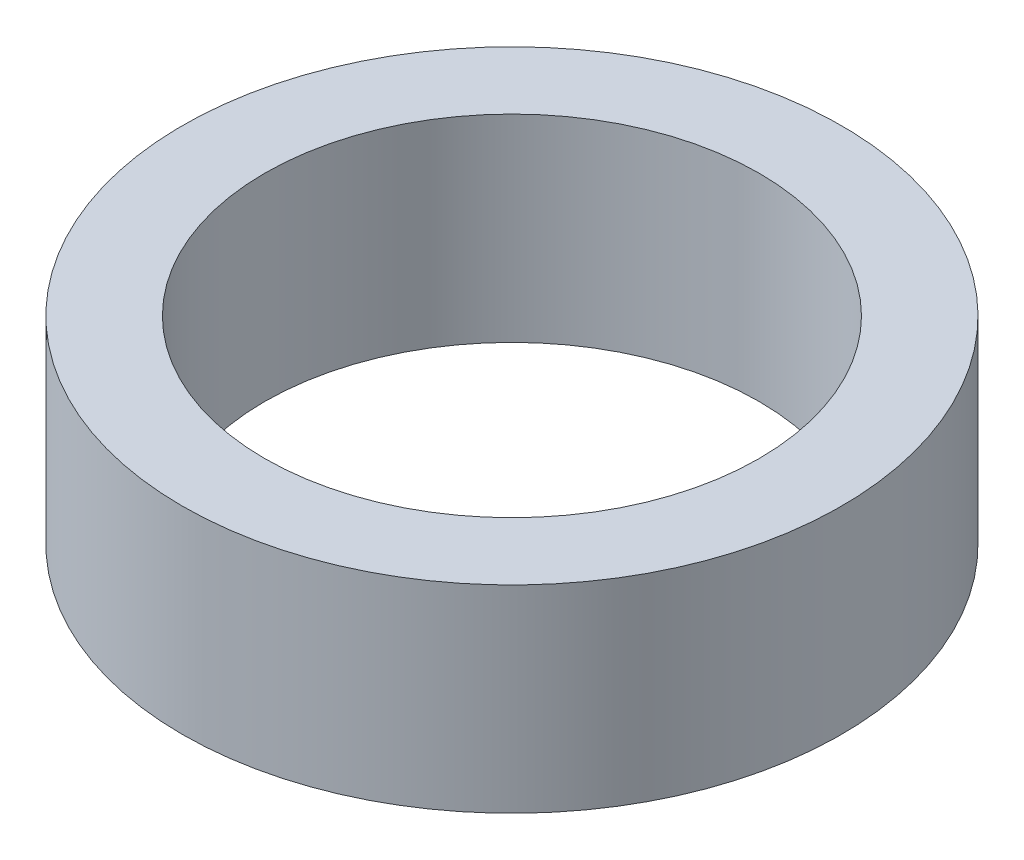
ISO-10303-21;
HEADER;
FILE_DESCRIPTION(('STEP AP214'),'2;1');
FILE_NAME('part.step','',(''),(''),'','','');
FILE_SCHEMA(('AUTOMOTIVE_DESIGN { 1 0 10303 214 1 1 1 1 }'));
ENDSEC;
DATA;
#1=APPLICATION_CONTEXT('core data for automotive mechanical design processes');
#2=APPLICATION_PROTOCOL_DEFINITION('international standard','automotive_design',2000,#1);
#3=PRODUCT_CONTEXT('',#1,'mechanical');
#4=PRODUCT('Part','Part','',(#3));
#5=PRODUCT_RELATED_PRODUCT_CATEGORY('part','',(#4));
#6=PRODUCT_DEFINITION_FORMATION('','',#4);
#7=PRODUCT_DEFINITION_CONTEXT('part definition',#1,'design');
#8=PRODUCT_DEFINITION('design','',#6,#7);
#9=PRODUCT_DEFINITION_SHAPE('','',#8);
#10=(LENGTH_UNIT() NAMED_UNIT(*) SI_UNIT(.MILLI.,.METRE.));
#11=(NAMED_UNIT(*) PLANE_ANGLE_UNIT() SI_UNIT($,.RADIAN.));
#12=(NAMED_UNIT(*) SI_UNIT($,.STERADIAN.) SOLID_ANGLE_UNIT());
#13=UNCERTAINTY_MEASURE_WITH_UNIT(LENGTH_MEASURE(1.E-05),#10,'distance_accuracy_value','');
#14=(GEOMETRIC_REPRESENTATION_CONTEXT(3) GLOBAL_UNCERTAINTY_ASSIGNED_CONTEXT((#13)) GLOBAL_UNIT_ASSIGNED_CONTEXT((#10,
#11,#12)) REPRESENTATION_CONTEXT('',''));
#15=CARTESIAN_POINT('',(0.,0.,0.));
#16=DIRECTION('',(0.,0.,1.));
#17=DIRECTION('',(1.,0.,0.));
#18=AXIS2_PLACEMENT_3D('',#15,#16,#17);
#19=CARTESIAN_POINT('',(0.,12.,0.));
#20=DIRECTION('',(0.,1.,0.));
#21=DIRECTION('',(0.,0.,1.));
#22=AXIS2_PLACEMENT_3D('',#19,#20,#21);
#23=PLANE('',#22);
#24=CARTESIAN_POINT('',(0.,12.,0.));
#25=DIRECTION('',(0.,1.,0.));
#26=DIRECTION('',(0.,0.,1.));
#27=AXIS2_PLACEMENT_3D('',#24,#25,#26);
#28=CIRCLE('',#27,20.);
#29=CARTESIAN_POINT('',(0.,12.,20.));
#30=VERTEX_POINT('',#29);
#31=EDGE_CURVE('E10',#30,#30,#28,.T.);
#32=ORIENTED_EDGE('',*,*,#31,.T.);
#33=EDGE_LOOP('',(#32));
#34=FACE_BOUND('',#33,.T.);
#35=CARTESIAN_POINT('',(0.,12.,0.));
#36=DIRECTION('',(0.,1.,0.));
#37=DIRECTION('',(0.,0.,1.));
#38=AXIS2_PLACEMENT_3D('',#35,#36,#37);
#39=CIRCLE('',#38,15.);
#40=CARTESIAN_POINT('',(0.,12.,15.));
#41=VERTEX_POINT('',#40);
#42=EDGE_CURVE('E52',#41,#41,#39,.T.);
#43=ORIENTED_EDGE('',*,*,#42,.F.);
#44=EDGE_LOOP('',(#43));
#45=FACE_BOUND('',#44,.T.);
#46=ADVANCED_FACE('F39',(#34,#45),#23,.T.);
#47=CARTESIAN_POINT('',(0.,0.,0.));
#48=DIRECTION('',(0.,1.,0.));
#49=DIRECTION('',(0.,0.,1.));
#50=AXIS2_PLACEMENT_3D('',#47,#48,#49);
#51=PLANE('',#50);
#52=CARTESIAN_POINT('',(0.,0.,0.));
#53=DIRECTION('',(0.,1.,0.));
#54=DIRECTION('',(0.,0.,1.));
#55=AXIS2_PLACEMENT_3D('',#52,#53,#54);
#56=CIRCLE('',#55,20.);
#57=CARTESIAN_POINT('',(0.,0.,20.));
#58=VERTEX_POINT('',#57);
#59=EDGE_CURVE('E43',#58,#58,#56,.T.);
#60=ORIENTED_EDGE('',*,*,#59,.F.);
#61=EDGE_LOOP('',(#60));
#62=FACE_BOUND('',#61,.T.);
#63=CARTESIAN_POINT('',(0.,0.,0.));
#64=DIRECTION('',(0.,1.,0.));
#65=DIRECTION('',(0.,0.,1.));
#66=AXIS2_PLACEMENT_3D('',#63,#64,#65);
#67=CIRCLE('',#66,15.);
#68=CARTESIAN_POINT('',(0.,0.,15.));
#69=VERTEX_POINT('',#68);
#70=EDGE_CURVE('E54',#69,#69,#67,.T.);
#71=ORIENTED_EDGE('',*,*,#70,.T.);
#72=EDGE_LOOP('',(#71));
#73=FACE_BOUND('',#72,.T.);
#74=ADVANCED_FACE('F66',(#62,#73),#51,.F.);
#75=CARTESIAN_POINT('',(0.,12.,0.));
#76=DIRECTION('',(0.,-1.,0.));
#77=DIRECTION('',(0.,0.,-1.));
#78=AXIS2_PLACEMENT_3D('',#75,#76,#77);
#79=CYLINDRICAL_SURFACE('',#78,20.);
#80=ORIENTED_EDGE('',*,*,#31,.F.);
#81=EDGE_LOOP('',(#80));
#82=FACE_BOUND('',#81,.T.);
#83=ORIENTED_EDGE('',*,*,#59,.T.);
#84=EDGE_LOOP('',(#83));
#85=FACE_BOUND('',#84,.T.);
#86=ADVANCED_FACE('F41',(#82,#85),#79,.T.);
#87=CARTESIAN_POINT('',(0.,12.,0.));
#88=DIRECTION('',(0.,-1.,0.));
#89=DIRECTION('',(0.,0.,-1.));
#90=AXIS2_PLACEMENT_3D('',#87,#88,#89);
#91=CYLINDRICAL_SURFACE('',#90,15.);
#92=ORIENTED_EDGE('',*,*,#42,.T.);
#93=EDGE_LOOP('',(#92));
#94=FACE_BOUND('',#93,.T.);
#95=ORIENTED_EDGE('',*,*,#70,.F.);
#96=EDGE_LOOP('',(#95));
#97=FACE_BOUND('',#96,.T.);
#98=ADVANCED_FACE('F62',(#94,#97),#91,.F.);
#99=CLOSED_SHELL('',(#46,#74,#86,#98));
#100=MANIFOLD_SOLID_BREP('B2',#99);
#101=ADVANCED_BREP_SHAPE_REPRESENTATION('',(#18,#100),#14);
#102=SHAPE_DEFINITION_REPRESENTATION(#9,#101);
ENDSEC;
END-ISO-10303-21;
